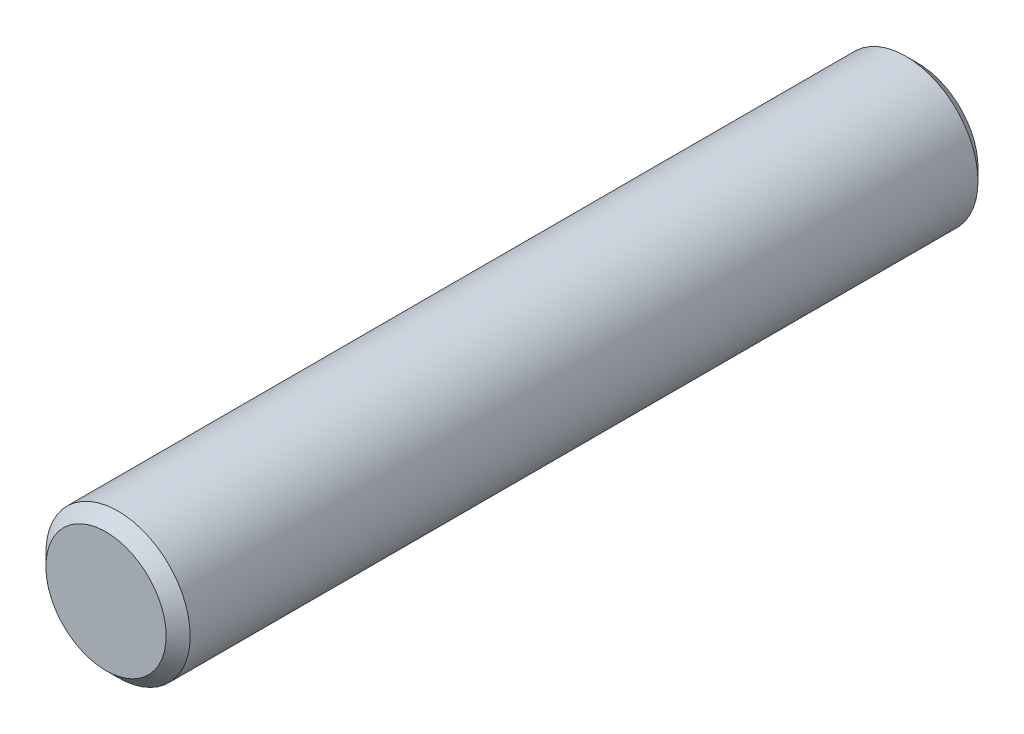
ISO-10303-21;
HEADER;
FILE_DESCRIPTION(('STEP AP214'),'2;1');
FILE_NAME('part.step','',(''),(''),'','','');
FILE_SCHEMA(('AUTOMOTIVE_DESIGN { 1 0 10303 214 1 1 1 1 }'));
ENDSEC;
DATA;
#1=APPLICATION_CONTEXT('core data for automotive mechanical design processes');
#2=APPLICATION_PROTOCOL_DEFINITION('international standard','automotive_design',2000,#1);
#3=PRODUCT_CONTEXT('',#1,'mechanical');
#4=PRODUCT('Part','Part','',(#3));
#5=PRODUCT_RELATED_PRODUCT_CATEGORY('part','',(#4));
#6=PRODUCT_DEFINITION_FORMATION('','',#4);
#7=PRODUCT_DEFINITION_CONTEXT('part definition',#1,'design');
#8=PRODUCT_DEFINITION('design','',#6,#7);
#9=PRODUCT_DEFINITION_SHAPE('','',#8);
#10=(LENGTH_UNIT() NAMED_UNIT(*) SI_UNIT(.MILLI.,.METRE.));
#11=(NAMED_UNIT(*) PLANE_ANGLE_UNIT() SI_UNIT($,.RADIAN.));
#12=(NAMED_UNIT(*) SI_UNIT($,.STERADIAN.) SOLID_ANGLE_UNIT());
#13=UNCERTAINTY_MEASURE_WITH_UNIT(LENGTH_MEASURE(1.E-05),#10,'distance_accuracy_value','');
#14=(GEOMETRIC_REPRESENTATION_CONTEXT(3) GLOBAL_UNCERTAINTY_ASSIGNED_CONTEXT((#13)) GLOBAL_UNIT_ASSIGNED_CONTEXT((#10,
#11,#12)) REPRESENTATION_CONTEXT('',''));
#15=CARTESIAN_POINT('',(0.,0.,0.));
#16=DIRECTION('',(0.,0.,1.));
#17=DIRECTION('',(1.,0.,0.));
#18=AXIS2_PLACEMENT_3D('',#15,#16,#17);
#19=CARTESIAN_POINT('',(0.,0.,33.75924676));
#20=DIRECTION('',(0.,0.,-1.));
#21=DIRECTION('',(-1.,0.,0.));
#22=AXIS2_PLACEMENT_3D('',#19,#20,#21);
#23=CYLINDRICAL_SURFACE('',#22,3.);
#24=CARTESIAN_POINT('',(0.,0.,0.5));
#25=DIRECTION('',(0.,0.,1.));
#26=DIRECTION('',(1.,0.,0.));
#27=AXIS2_PLACEMENT_3D('',#24,#25,#26);
#28=CIRCLE('',#27,3.);
#29=CARTESIAN_POINT('',(3.,0.,0.5));
#30=VERTEX_POINT('',#29);
#31=EDGE_CURVE('E58',#30,#30,#28,.T.);
#32=ORIENTED_EDGE('',*,*,#31,.T.);
#33=EDGE_LOOP('',(#32));
#34=FACE_BOUND('',#33,.T.);
#35=CARTESIAN_POINT('',(0.,0.,33.25924676));
#36=DIRECTION('',(0.,0.,1.));
#37=DIRECTION('',(1.,0.,0.));
#38=AXIS2_PLACEMENT_3D('',#35,#36,#37);
#39=CIRCLE('',#38,3.);
#40=CARTESIAN_POINT('',(3.,0.,33.25924676));
#41=VERTEX_POINT('',#40);
#42=EDGE_CURVE('E63',#41,#41,#39,.F.);
#43=ORIENTED_EDGE('',*,*,#42,.T.);
#44=EDGE_LOOP('',(#43));
#45=FACE_BOUND('',#44,.T.);
#46=ADVANCED_FACE('F44',(#34,#45),#23,.T.);
#47=CARTESIAN_POINT('',(0.,0.,33.75924676));
#48=DIRECTION('',(0.,0.,1.));
#49=DIRECTION('',(1.,0.,0.));
#50=AXIS2_PLACEMENT_3D('',#47,#48,#49);
#51=PLANE('',#50);
#52=CARTESIAN_POINT('',(0.,0.,33.75924676));
#53=DIRECTION('',(0.,0.,1.));
#54=DIRECTION('',(1.,0.,0.));
#55=AXIS2_PLACEMENT_3D('',#52,#53,#54);
#56=CIRCLE('',#55,2.5);
#57=CARTESIAN_POINT('',(2.5,0.,33.75924676));
#58=VERTEX_POINT('',#57);
#59=EDGE_CURVE('E10',#58,#58,#56,.T.);
#60=ORIENTED_EDGE('',*,*,#59,.T.);
#61=EDGE_LOOP('',(#60));
#62=FACE_BOUND('',#61,.T.);
#63=ADVANCED_FACE('F80',(#62),#51,.T.);
#64=CARTESIAN_POINT('',(0.,0.,0.));
#65=DIRECTION('',(0.,0.,1.));
#66=DIRECTION('',(1.,0.,0.));
#67=AXIS2_PLACEMENT_3D('',#64,#65,#66);
#68=PLANE('',#67);
#69=CARTESIAN_POINT('',(0.,0.,0.));
#70=DIRECTION('',(0.,0.,1.));
#71=DIRECTION('',(1.,0.,0.));
#72=AXIS2_PLACEMENT_3D('',#69,#70,#71);
#73=CIRCLE('',#72,2.5);
#74=CARTESIAN_POINT('',(2.5,0.,0.));
#75=VERTEX_POINT('',#74);
#76=EDGE_CURVE('E53',#75,#75,#73,.F.);
#77=ORIENTED_EDGE('',*,*,#76,.T.);
#78=EDGE_LOOP('',(#77));
#79=FACE_BOUND('',#78,.T.);
#80=ADVANCED_FACE('F77',(#79),#68,.F.);
#81=CARTESIAN_POINT('',(0.,0.,0.5));
#82=DIRECTION('',(0.,0.,1.));
#83=DIRECTION('',(1.,0.,0.));
#84=AXIS2_PLACEMENT_3D('',#81,#82,#83);
#85=CONICAL_SURFACE('',#84,3.,0.785398163397449);
#86=ORIENTED_EDGE('',*,*,#76,.F.);
#87=EDGE_LOOP('',(#86));
#88=FACE_BOUND('',#87,.T.);
#89=ORIENTED_EDGE('',*,*,#31,.F.);
#90=EDGE_LOOP('',(#89));
#91=FACE_BOUND('',#90,.T.);
#92=ADVANCED_FACE('F73',(#88,#91),#85,.T.);
#93=CARTESIAN_POINT('',(0.,0.,33.75924676));
#94=DIRECTION('',(0.,0.,-1.));
#95=DIRECTION('',(-1.,0.,0.));
#96=AXIS2_PLACEMENT_3D('',#93,#94,#95);
#97=CONICAL_SURFACE('',#96,2.5,0.785398163397453);
#98=ORIENTED_EDGE('',*,*,#42,.F.);
#99=EDGE_LOOP('',(#98));
#100=FACE_BOUND('',#99,.T.);
#101=ORIENTED_EDGE('',*,*,#59,.F.);
#102=EDGE_LOOP('',(#101));
#103=FACE_BOUND('',#102,.T.);
#104=ADVANCED_FACE('F47',(#100,#103),#97,.T.);
#105=CLOSED_SHELL('',(#46,#63,#80,#92,#104));
#106=MANIFOLD_SOLID_BREP('B2',#105);
#107=ADVANCED_BREP_SHAPE_REPRESENTATION('',(#18,#106),#14);
#108=SHAPE_DEFINITION_REPRESENTATION(#9,#107);
ENDSEC;
END-ISO-10303-21;
